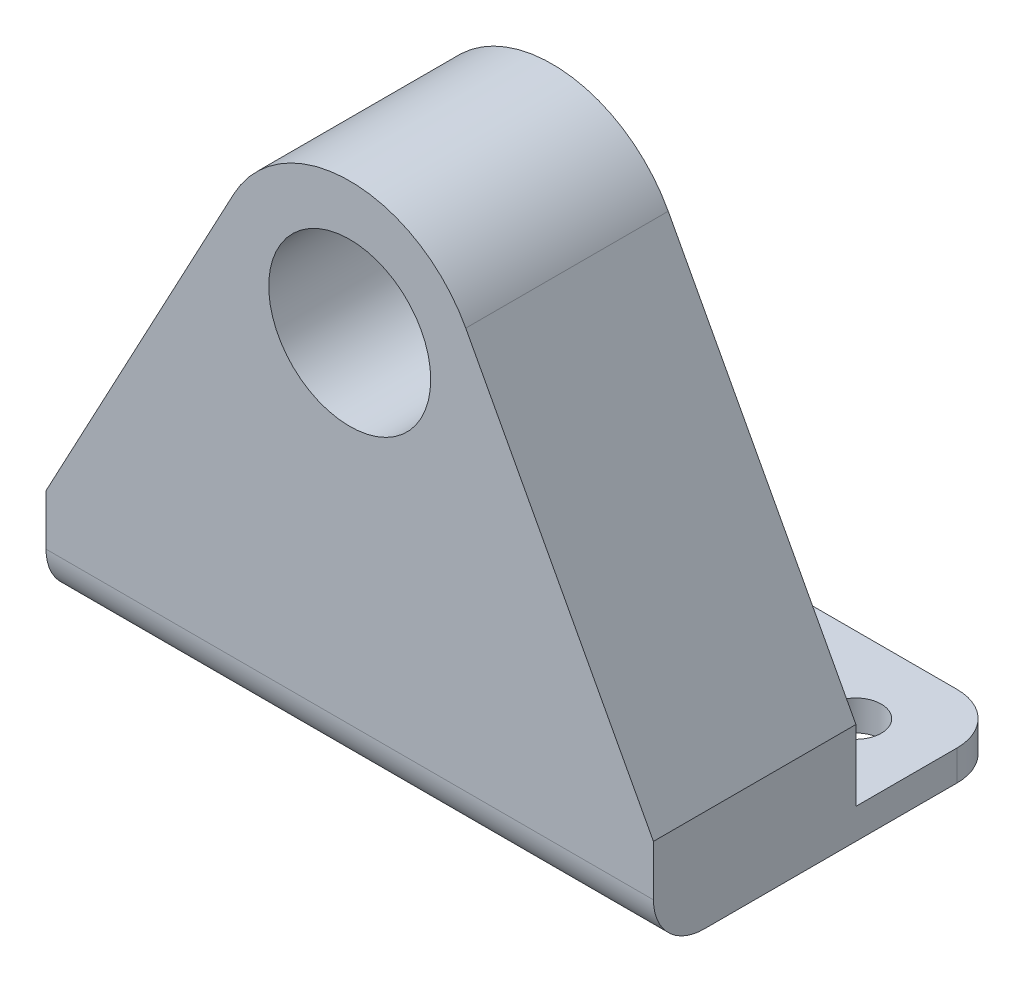
ISO-10303-21;
HEADER;
FILE_DESCRIPTION(('STEP AP214'),'2;1');
FILE_NAME('part.step','',(''),(''),'','','');
FILE_SCHEMA(('AUTOMOTIVE_DESIGN { 1 0 10303 214 1 1 1 1 }'));
ENDSEC;
DATA;
#1=APPLICATION_CONTEXT('core data for automotive mechanical design processes');
#2=APPLICATION_PROTOCOL_DEFINITION('international standard','automotive_design',2000,#1);
#3=PRODUCT_CONTEXT('',#1,'mechanical');
#4=PRODUCT('Part','Part','',(#3));
#5=PRODUCT_RELATED_PRODUCT_CATEGORY('part','',(#4));
#6=PRODUCT_DEFINITION_FORMATION('','',#4);
#7=PRODUCT_DEFINITION_CONTEXT('part definition',#1,'design');
#8=PRODUCT_DEFINITION('design','',#6,#7);
#9=PRODUCT_DEFINITION_SHAPE('','',#8);
#10=(LENGTH_UNIT() NAMED_UNIT(*) SI_UNIT(.MILLI.,.METRE.));
#11=(NAMED_UNIT(*) PLANE_ANGLE_UNIT() SI_UNIT($,.RADIAN.));
#12=(NAMED_UNIT(*) SI_UNIT($,.STERADIAN.) SOLID_ANGLE_UNIT());
#13=UNCERTAINTY_MEASURE_WITH_UNIT(LENGTH_MEASURE(1.E-05),#10,'distance_accuracy_value','');
#14=(GEOMETRIC_REPRESENTATION_CONTEXT(3) GLOBAL_UNCERTAINTY_ASSIGNED_CONTEXT((#13)) GLOBAL_UNIT_ASSIGNED_CONTEXT((#10,
#11,#12)) REPRESENTATION_CONTEXT('',''));
#15=CARTESIAN_POINT('',(0.,0.,0.));
#16=DIRECTION('',(0.,0.,1.));
#17=DIRECTION('',(1.,0.,0.));
#18=AXIS2_PLACEMENT_3D('',#15,#16,#17);
#19=CARTESIAN_POINT('',(0.,0.,0.));
#20=DIRECTION('',(0.,0.,1.));
#21=DIRECTION('',(1.,0.,0.));
#22=AXIS2_PLACEMENT_3D('',#19,#20,#21);
#23=PLANE('',#22);
#24=CARTESIAN_POINT('',(0.,0.,0.));
#25=DIRECTION('',(0.,0.,1.));
#26=DIRECTION('',(1.,0.,0.));
#27=AXIS2_PLACEMENT_3D('',#24,#25,#26);
#28=CIRCLE('',#27,8.);
#29=CARTESIAN_POINT('',(8.,0.,0.));
#30=VERTEX_POINT('',#29);
#31=EDGE_CURVE('E156',#30,#30,#28,.T.);
#32=ORIENTED_EDGE('',*,*,#31,.T.);
#33=EDGE_LOOP('',(#32));
#34=FACE_BOUND('',#33,.T.);
#35=DIRECTION('',(1.,0.,0.));
#36=VECTOR('',#35,1.);
#37=CARTESIAN_POINT('',(30.,-35.5,0.));
#38=LINE('',#37,#36);
#39=CARTESIAN_POINT('',(-30.,-35.5,0.));
#40=VERTEX_POINT('',#39);
#41=CARTESIAN_POINT('',(30.,-35.5,0.));
#42=VERTEX_POINT('',#41);
#43=EDGE_CURVE('E137',#40,#42,#38,.T.);
#44=ORIENTED_EDGE('',*,*,#43,.F.);
#45=DIRECTION('',(0.,-1.,0.));
#46=VECTOR('',#45,1.);
#47=CARTESIAN_POINT('',(-30.,-38.5,0.));
#48=LINE('',#47,#46);
#49=CARTESIAN_POINT('',(-30.,-28.5,0.));
#50=VERTEX_POINT('',#49);
#51=EDGE_CURVE('E164',#50,#40,#48,.T.);
#52=ORIENTED_EDGE('',*,*,#51,.F.);
#53=DIRECTION('',(-0.471909255380302,-0.88164712594462,0.));
#54=VECTOR('',#53,1.);
#55=CARTESIAN_POINT('',(-30.,-28.5,0.));
#56=LINE('',#55,#54);
#57=CARTESIAN_POINT('',(-11.4614126372801,6.13482031994392,0.));
#58=VERTEX_POINT('',#57);
#59=EDGE_CURVE('E177',#58,#50,#56,.T.);
#60=ORIENTED_EDGE('',*,*,#59,.F.);
#61=CARTESIAN_POINT('',(0.,0.,0.));
#62=DIRECTION('',(0.,0.,1.));
#63=DIRECTION('',(1.,0.,0.));
#64=AXIS2_PLACEMENT_3D('',#61,#62,#63);
#65=CIRCLE('',#64,13.);
#66=CARTESIAN_POINT('',(11.4614126372801,6.13482031994393,0.));
#67=VERTEX_POINT('',#66);
#68=EDGE_CURVE('E175',#67,#58,#65,.T.);
#69=ORIENTED_EDGE('',*,*,#68,.F.);
#70=DIRECTION('',(-0.471909255380302,0.88164712594462,0.));
#71=VECTOR('',#70,1.);
#72=CARTESIAN_POINT('',(30.,-28.5,0.));
#73=LINE('',#72,#71);
#74=CARTESIAN_POINT('',(30.,-28.5,0.));
#75=VERTEX_POINT('',#74);
#76=EDGE_CURVE('E140',#75,#67,#73,.T.);
#77=ORIENTED_EDGE('',*,*,#76,.F.);
#78=DIRECTION('',(0.,1.,0.));
#79=VECTOR('',#78,1.);
#80=CARTESIAN_POINT('',(30.,-28.5,0.));
#81=LINE('',#80,#79);
#82=EDGE_CURVE('E124',#42,#75,#81,.T.);
#83=ORIENTED_EDGE('',*,*,#82,.F.);
#84=EDGE_LOOP('',(#44,#52,#60,#69,#77,#83));
#85=FACE_BOUND('',#84,.T.);
#86=ADVANCED_FACE('F38',(#34,#85),#23,.F.);
#87=CARTESIAN_POINT('',(0.,0.,20.));
#88=DIRECTION('',(0.,0.,1.));
#89=DIRECTION('',(1.,0.,0.));
#90=AXIS2_PLACEMENT_3D('',#87,#88,#89);
#91=PLANE('',#90);
#92=DIRECTION('',(0.,-1.,0.));
#93=VECTOR('',#92,1.);
#94=CARTESIAN_POINT('',(-30.,-38.5,20.));
#95=LINE('',#94,#93);
#96=CARTESIAN_POINT('',(-30.,-28.5,20.));
#97=VERTEX_POINT('',#96);
#98=CARTESIAN_POINT('',(-30.,-33.5,20.));
#99=VERTEX_POINT('',#98);
#100=EDGE_CURVE('E170',#97,#99,#95,.T.);
#101=ORIENTED_EDGE('',*,*,#100,.T.);
#102=DIRECTION('',(1.,0.,0.));
#103=VECTOR('',#102,1.);
#104=CARTESIAN_POINT('',(30.,-33.5,20.));
#105=LINE('',#104,#103);
#106=CARTESIAN_POINT('',(30.,-33.5,20.));
#107=VERTEX_POINT('',#106);
#108=EDGE_CURVE('E195',#99,#107,#105,.T.);
#109=ORIENTED_EDGE('',*,*,#108,.T.);
#110=DIRECTION('',(0.,1.,0.));
#111=VECTOR('',#110,1.);
#112=CARTESIAN_POINT('',(30.,-28.5,20.));
#113=LINE('',#112,#111);
#114=CARTESIAN_POINT('',(30.,-28.5,20.));
#115=VERTEX_POINT('',#114);
#116=EDGE_CURVE('E161',#107,#115,#113,.T.);
#117=ORIENTED_EDGE('',*,*,#116,.T.);
#118=DIRECTION('',(-0.471909255380302,0.88164712594462,0.));
#119=VECTOR('',#118,1.);
#120=CARTESIAN_POINT('',(30.,-28.5,20.));
#121=LINE('',#120,#119);
#122=CARTESIAN_POINT('',(11.4614126372801,6.13482031994393,20.));
#123=VERTEX_POINT('',#122);
#124=EDGE_CURVE('E163',#115,#123,#121,.T.);
#125=ORIENTED_EDGE('',*,*,#124,.T.);
#126=CARTESIAN_POINT('',(0.,0.,20.));
#127=DIRECTION('',(0.,0.,1.));
#128=DIRECTION('',(1.,0.,0.));
#129=AXIS2_PLACEMENT_3D('',#126,#127,#128);
#130=CIRCLE('',#129,13.);
#131=CARTESIAN_POINT('',(-11.4614126372801,6.13482031994392,20.));
#132=VERTEX_POINT('',#131);
#133=EDGE_CURVE('E166',#123,#132,#130,.T.);
#134=ORIENTED_EDGE('',*,*,#133,.T.);
#135=DIRECTION('',(-0.471909255380302,-0.88164712594462,0.));
#136=VECTOR('',#135,1.);
#137=CARTESIAN_POINT('',(-30.,-28.5,20.));
#138=LINE('',#137,#136);
#139=EDGE_CURVE('E168',#132,#97,#138,.T.);
#140=ORIENTED_EDGE('',*,*,#139,.T.);
#141=EDGE_LOOP('',(#101,#109,#117,#125,#134,#140));
#142=FACE_BOUND('',#141,.T.);
#143=CARTESIAN_POINT('',(0.,0.,20.));
#144=DIRECTION('',(0.,0.,1.));
#145=DIRECTION('',(1.,0.,0.));
#146=AXIS2_PLACEMENT_3D('',#143,#144,#145);
#147=CIRCLE('',#146,8.);
#148=CARTESIAN_POINT('',(8.,0.,20.));
#149=VERTEX_POINT('',#148);
#150=EDGE_CURVE('E141',#149,#149,#147,.T.);
#151=ORIENTED_EDGE('',*,*,#150,.F.);
#152=EDGE_LOOP('',(#151));
#153=FACE_BOUND('',#152,.T.);
#154=ADVANCED_FACE('F237',(#142,#153),#91,.T.);
#155=CARTESIAN_POINT('',(30.,-38.5,20.));
#156=DIRECTION('',(0.,1.,0.));
#157=DIRECTION('',(-1.,0.,0.));
#158=AXIS2_PLACEMENT_3D('',#155,#156,#157);
#159=PLANE('',#158);
#160=CARTESIAN_POINT('',(22.5,-38.5,-7.5));
#161=DIRECTION('',(0.,-1.,0.));
#162=DIRECTION('',(1.,0.,0.));
#163=AXIS2_PLACEMENT_3D('',#160,#161,#162);
#164=CIRCLE('',#163,2.5);
#165=CARTESIAN_POINT('',(25.,-38.5,-7.5));
#166=VERTEX_POINT('',#165);
#167=EDGE_CURVE('E197',#166,#166,#164,.T.);
#168=ORIENTED_EDGE('',*,*,#167,.F.);
#169=EDGE_LOOP('',(#168));
#170=FACE_BOUND('',#169,.T.);
#171=CARTESIAN_POINT('',(-22.5,-38.5,-7.5));
#172=DIRECTION('',(0.,-1.,0.));
#173=DIRECTION('',(1.,0.,0.));
#174=AXIS2_PLACEMENT_3D('',#171,#172,#173);
#175=CIRCLE('',#174,2.5);
#176=CARTESIAN_POINT('',(-20.,-38.5,-7.5));
#177=VERTEX_POINT('',#176);
#178=EDGE_CURVE('E404',#177,#177,#175,.T.);
#179=ORIENTED_EDGE('',*,*,#178,.F.);
#180=EDGE_LOOP('',(#179));
#181=FACE_BOUND('',#180,.T.);
#182=DIRECTION('',(0.,0.,-1.));
#183=VECTOR('',#182,1.);
#184=CARTESIAN_POINT('',(30.,-38.5,20.));
#185=LINE('',#184,#183);
#186=CARTESIAN_POINT('',(30.,-38.5,15.));
#187=VERTEX_POINT('',#186);
#188=CARTESIAN_POINT('',(30.,-38.5,-10.));
#189=VERTEX_POINT('',#188);
#190=EDGE_CURVE('E193',#187,#189,#185,.T.);
#191=ORIENTED_EDGE('',*,*,#190,.F.);
#192=DIRECTION('',(1.,0.,0.));
#193=VECTOR('',#192,1.);
#194=CARTESIAN_POINT('',(-30.,-38.5,15.));
#195=LINE('',#194,#193);
#196=CARTESIAN_POINT('',(-30.,-38.5,15.));
#197=VERTEX_POINT('',#196);
#198=EDGE_CURVE('E208',#187,#197,#195,.F.);
#199=ORIENTED_EDGE('',*,*,#198,.T.);
#200=DIRECTION('',(0.,0.,-1.));
#201=VECTOR('',#200,1.);
#202=CARTESIAN_POINT('',(-30.,-38.5,20.));
#203=LINE('',#202,#201);
#204=CARTESIAN_POINT('',(-30.,-38.5,-10.));
#205=VERTEX_POINT('',#204);
#206=EDGE_CURVE('E172',#197,#205,#203,.T.);
#207=ORIENTED_EDGE('',*,*,#206,.T.);
#208=CARTESIAN_POINT('',(-25.,-38.5,-10.));
#209=DIRECTION('',(0.,1.,0.));
#210=DIRECTION('',(-1.,0.,0.));
#211=AXIS2_PLACEMENT_3D('',#208,#209,#210);
#212=CIRCLE('',#211,5.);
#213=CARTESIAN_POINT('',(-25.,-38.5,-15.));
#214=VERTEX_POINT('',#213);
#215=EDGE_CURVE('E204',#205,#214,#212,.F.);
#216=ORIENTED_EDGE('',*,*,#215,.T.);
#217=DIRECTION('',(-1.,0.,0.));
#218=VECTOR('',#217,1.);
#219=CARTESIAN_POINT('',(30.,-38.5,-15.));
#220=LINE('',#219,#218);
#221=CARTESIAN_POINT('',(25.,-38.5,-15.));
#222=VERTEX_POINT('',#221);
#223=EDGE_CURVE('E145',#222,#214,#220,.T.);
#224=ORIENTED_EDGE('',*,*,#223,.F.);
#225=CARTESIAN_POINT('',(25.,-38.5,-10.));
#226=DIRECTION('',(0.,1.,0.));
#227=DIRECTION('',(-1.,0.,0.));
#228=AXIS2_PLACEMENT_3D('',#225,#226,#227);
#229=CIRCLE('',#228,5.);
#230=EDGE_CURVE('E206',#222,#189,#229,.F.);
#231=ORIENTED_EDGE('',*,*,#230,.T.);
#232=EDGE_LOOP('',(#191,#199,#207,#216,#224,#231));
#233=FACE_BOUND('',#232,.T.);
#234=ADVANCED_FACE('F225',(#170,#181,#233),#159,.F.);
#235=CARTESIAN_POINT('',(30.,-28.5,20.));
#236=DIRECTION('',(-1.,0.,0.));
#237=DIRECTION('',(0.,0.,1.));
#238=AXIS2_PLACEMENT_3D('',#235,#236,#237);
#239=PLANE('',#238);
#240=ORIENTED_EDGE('',*,*,#116,.F.);
#241=CARTESIAN_POINT('',(30.,-33.5,15.));
#242=DIRECTION('',(-1.,0.,0.));
#243=DIRECTION('',(0.,0.,1.));
#244=AXIS2_PLACEMENT_3D('',#241,#242,#243);
#245=CIRCLE('',#244,5.);
#246=EDGE_CURVE('E202',#107,#187,#245,.F.);
#247=ORIENTED_EDGE('',*,*,#246,.T.);
#248=ORIENTED_EDGE('',*,*,#190,.T.);
#249=DIRECTION('',(0.,-1.,0.));
#250=VECTOR('',#249,1.);
#251=CARTESIAN_POINT('',(30.,-28.5,-10.));
#252=LINE('',#251,#250);
#253=CARTESIAN_POINT('',(30.,-35.5,-10.));
#254=VERTEX_POINT('',#253);
#255=EDGE_CURVE('E128',#189,#254,#252,.F.);
#256=ORIENTED_EDGE('',*,*,#255,.T.);
#257=DIRECTION('',(0.,0.,1.));
#258=VECTOR('',#257,1.);
#259=CARTESIAN_POINT('',(30.,-35.5,-15.));
#260=LINE('',#259,#258);
#261=EDGE_CURVE('E119',#254,#42,#260,.T.);
#262=ORIENTED_EDGE('',*,*,#261,.T.);
#263=ORIENTED_EDGE('',*,*,#82,.T.);
#264=DIRECTION('',(0.,0.,-1.));
#265=VECTOR('',#264,1.);
#266=CARTESIAN_POINT('',(30.,-28.5,20.));
#267=LINE('',#266,#265);
#268=EDGE_CURVE('E191',#115,#75,#267,.T.);
#269=ORIENTED_EDGE('',*,*,#268,.F.);
#270=EDGE_LOOP('',(#240,#247,#248,#256,#262,#263,#269));
#271=FACE_BOUND('',#270,.T.);
#272=ADVANCED_FACE('F122',(#271),#239,.F.);
#273=CARTESIAN_POINT('',(30.,-28.5,20.));
#274=DIRECTION('',(-0.88164712594462,-0.471909255380302,0.));
#275=DIRECTION('',(0.471909255380302,-0.88164712594462,0.));
#276=AXIS2_PLACEMENT_3D('',#273,#274,#275);
#277=PLANE('',#276);
#278=ORIENTED_EDGE('',*,*,#76,.T.);
#279=DIRECTION('',(0.,0.,-1.));
#280=VECTOR('',#279,1.);
#281=CARTESIAN_POINT('',(11.4614126372801,6.13482031994393,20.));
#282=LINE('',#281,#280);
#283=EDGE_CURVE('E188',#123,#67,#282,.T.);
#284=ORIENTED_EDGE('',*,*,#283,.F.);
#285=ORIENTED_EDGE('',*,*,#124,.F.);
#286=ORIENTED_EDGE('',*,*,#268,.T.);
#287=EDGE_LOOP('',(#278,#284,#285,#286));
#288=FACE_BOUND('',#287,.T.);
#289=ADVANCED_FACE('F252',(#288),#277,.F.);
#290=CARTESIAN_POINT('',(0.,0.,20.));
#291=DIRECTION('',(0.,0.,-1.));
#292=DIRECTION('',(-1.,0.,0.));
#293=AXIS2_PLACEMENT_3D('',#290,#291,#292);
#294=CYLINDRICAL_SURFACE('',#293,13.);
#295=ORIENTED_EDGE('',*,*,#68,.T.);
#296=DIRECTION('',(0.,0.,-1.));
#297=VECTOR('',#296,1.);
#298=CARTESIAN_POINT('',(-11.4614126372801,6.13482031994392,20.));
#299=LINE('',#298,#297);
#300=EDGE_CURVE('E185',#132,#58,#299,.T.);
#301=ORIENTED_EDGE('',*,*,#300,.F.);
#302=ORIENTED_EDGE('',*,*,#133,.F.);
#303=ORIENTED_EDGE('',*,*,#283,.T.);
#304=EDGE_LOOP('',(#295,#301,#302,#303));
#305=FACE_BOUND('',#304,.T.);
#306=ADVANCED_FACE('F248',(#305),#294,.T.);
#307=CARTESIAN_POINT('',(-30.,-28.5,20.));
#308=DIRECTION('',(0.88164712594462,-0.471909255380302,0.));
#309=DIRECTION('',(0.471909255380302,0.88164712594462,0.));
#310=AXIS2_PLACEMENT_3D('',#307,#308,#309);
#311=PLANE('',#310);
#312=ORIENTED_EDGE('',*,*,#59,.T.);
#313=DIRECTION('',(0.,0.,-1.));
#314=VECTOR('',#313,1.);
#315=CARTESIAN_POINT('',(-30.,-28.5,20.));
#316=LINE('',#315,#314);
#317=EDGE_CURVE('E182',#97,#50,#316,.T.);
#318=ORIENTED_EDGE('',*,*,#317,.F.);
#319=ORIENTED_EDGE('',*,*,#139,.F.);
#320=ORIENTED_EDGE('',*,*,#300,.T.);
#321=EDGE_LOOP('',(#312,#318,#319,#320));
#322=FACE_BOUND('',#321,.T.);
#323=ADVANCED_FACE('F244',(#322),#311,.F.);
#324=CARTESIAN_POINT('',(-30.,-38.5,20.));
#325=DIRECTION('',(1.,0.,0.));
#326=DIRECTION('',(0.,1.,0.));
#327=AXIS2_PLACEMENT_3D('',#324,#325,#326);
#328=PLANE('',#327);
#329=ORIENTED_EDGE('',*,*,#206,.F.);
#330=CARTESIAN_POINT('',(-30.,-33.5,15.));
#331=DIRECTION('',(1.,0.,0.));
#332=DIRECTION('',(0.,1.,0.));
#333=AXIS2_PLACEMENT_3D('',#330,#331,#332);
#334=CIRCLE('',#333,5.);
#335=EDGE_CURVE('E212',#197,#99,#334,.F.);
#336=ORIENTED_EDGE('',*,*,#335,.T.);
#337=ORIENTED_EDGE('',*,*,#100,.F.);
#338=ORIENTED_EDGE('',*,*,#317,.T.);
#339=ORIENTED_EDGE('',*,*,#51,.T.);
#340=DIRECTION('',(0.,0.,1.));
#341=VECTOR('',#340,1.);
#342=CARTESIAN_POINT('',(-30.,-35.5,-15.));
#343=LINE('',#342,#341);
#344=CARTESIAN_POINT('',(-30.,-35.5,-10.));
#345=VERTEX_POINT('',#344);
#346=EDGE_CURVE('E130',#345,#40,#343,.T.);
#347=ORIENTED_EDGE('',*,*,#346,.F.);
#348=DIRECTION('',(0.,1.,0.));
#349=VECTOR('',#348,1.);
#350=CARTESIAN_POINT('',(-30.,-38.5,-10.));
#351=LINE('',#350,#349);
#352=EDGE_CURVE('E210',#345,#205,#351,.F.);
#353=ORIENTED_EDGE('',*,*,#352,.T.);
#354=EDGE_LOOP('',(#329,#336,#337,#338,#339,#347,#353));
#355=FACE_BOUND('',#354,.T.);
#356=ADVANCED_FACE('F220',(#355),#328,.F.);
#357=CARTESIAN_POINT('',(0.,0.,20.));
#358=DIRECTION('',(0.,0.,-1.));
#359=DIRECTION('',(-1.,0.,0.));
#360=AXIS2_PLACEMENT_3D('',#357,#358,#359);
#361=CYLINDRICAL_SURFACE('',#360,8.);
#362=ORIENTED_EDGE('',*,*,#150,.T.);
#363=EDGE_LOOP('',(#362));
#364=FACE_BOUND('',#363,.T.);
#365=ORIENTED_EDGE('',*,*,#31,.F.);
#366=EDGE_LOOP('',(#365));
#367=FACE_BOUND('',#366,.T.);
#368=ADVANCED_FACE('F275',(#364,#367),#361,.F.);
#369=CARTESIAN_POINT('',(30.,-35.5,-15.));
#370=DIRECTION('',(0.,-1.,0.));
#371=DIRECTION('',(0.,0.,-1.));
#372=AXIS2_PLACEMENT_3D('',#369,#370,#371);
#373=PLANE('',#372);
#374=CARTESIAN_POINT('',(22.5,-35.5,-7.5));
#375=DIRECTION('',(0.,-1.,0.));
#376=DIRECTION('',(0.,0.,-1.));
#377=AXIS2_PLACEMENT_3D('',#374,#375,#376);
#378=CIRCLE('',#377,2.5);
#379=CARTESIAN_POINT('',(22.5,-35.5,-10.));
#380=VERTEX_POINT('',#379);
#381=EDGE_CURVE('E146',#380,#380,#378,.T.);
#382=ORIENTED_EDGE('',*,*,#381,.T.);
#383=EDGE_LOOP('',(#382));
#384=FACE_BOUND('',#383,.T.);
#385=CARTESIAN_POINT('',(-22.5,-35.5,-7.5));
#386=DIRECTION('',(0.,-1.,0.));
#387=DIRECTION('',(0.,0.,-1.));
#388=AXIS2_PLACEMENT_3D('',#385,#386,#387);
#389=CIRCLE('',#388,2.5);
#390=CARTESIAN_POINT('',(-22.5,-35.5,-10.));
#391=VERTEX_POINT('',#390);
#392=EDGE_CURVE('E151',#391,#391,#389,.T.);
#393=ORIENTED_EDGE('',*,*,#392,.T.);
#394=EDGE_LOOP('',(#393));
#395=FACE_BOUND('',#394,.T.);
#396=ORIENTED_EDGE('',*,*,#261,.F.);
#397=CARTESIAN_POINT('',(25.,-35.5,-10.));
#398=DIRECTION('',(0.,-1.,0.));
#399=DIRECTION('',(0.,0.,-1.));
#400=AXIS2_PLACEMENT_3D('',#397,#398,#399);
#401=CIRCLE('',#400,5.);
#402=CARTESIAN_POINT('',(25.,-35.5,-15.));
#403=VERTEX_POINT('',#402);
#404=EDGE_CURVE('E11',#254,#403,#401,.F.);
#405=ORIENTED_EDGE('',*,*,#404,.T.);
#406=DIRECTION('',(1.,0.,0.));
#407=VECTOR('',#406,1.);
#408=CARTESIAN_POINT('',(30.,-35.5,-15.));
#409=LINE('',#408,#407);
#410=CARTESIAN_POINT('',(-25.,-35.5,-15.));
#411=VERTEX_POINT('',#410);
#412=EDGE_CURVE('E131',#411,#403,#409,.T.);
#413=ORIENTED_EDGE('',*,*,#412,.F.);
#414=CARTESIAN_POINT('',(-25.,-35.5,-10.));
#415=DIRECTION('',(0.,-1.,0.));
#416=DIRECTION('',(0.,0.,-1.));
#417=AXIS2_PLACEMENT_3D('',#414,#415,#416);
#418=CIRCLE('',#417,5.);
#419=EDGE_CURVE('E46',#411,#345,#418,.F.);
#420=ORIENTED_EDGE('',*,*,#419,.T.);
#421=ORIENTED_EDGE('',*,*,#346,.T.);
#422=ORIENTED_EDGE('',*,*,#43,.T.);
#423=EDGE_LOOP('',(#396,#405,#413,#420,#421,#422));
#424=FACE_BOUND('',#423,.T.);
#425=ADVANCED_FACE('F143',(#384,#395,#424),#373,.F.);
#426=CARTESIAN_POINT('',(0.,0.,-15.));
#427=DIRECTION('',(0.,0.,1.));
#428=DIRECTION('',(1.,0.,0.));
#429=AXIS2_PLACEMENT_3D('',#426,#427,#428);
#430=PLANE('',#429);
#431=ORIENTED_EDGE('',*,*,#412,.T.);
#432=DIRECTION('',(0.,-1.,0.));
#433=VECTOR('',#432,1.);
#434=CARTESIAN_POINT('',(25.,0.,-15.));
#435=LINE('',#434,#433);
#436=EDGE_CURVE('E216',#403,#222,#435,.T.);
#437=ORIENTED_EDGE('',*,*,#436,.T.);
#438=ORIENTED_EDGE('',*,*,#223,.T.);
#439=DIRECTION('',(0.,1.,0.));
#440=VECTOR('',#439,1.);
#441=CARTESIAN_POINT('',(-25.,0.,-15.));
#442=LINE('',#441,#440);
#443=EDGE_CURVE('E214',#214,#411,#442,.T.);
#444=ORIENTED_EDGE('',*,*,#443,.T.);
#445=EDGE_LOOP('',(#431,#437,#438,#444));
#446=FACE_BOUND('',#445,.T.);
#447=ADVANCED_FACE('F227',(#446),#430,.F.);
#448=CARTESIAN_POINT('',(-22.5,-18.5,-7.5));
#449=DIRECTION('',(0.,-1.,0.));
#450=DIRECTION('',(1.,0.,0.));
#451=AXIS2_PLACEMENT_3D('',#448,#449,#450);
#452=CYLINDRICAL_SURFACE('',#451,2.5);
#453=ORIENTED_EDGE('',*,*,#178,.T.);
#454=EDGE_LOOP('',(#453));
#455=FACE_BOUND('',#454,.T.);
#456=ORIENTED_EDGE('',*,*,#392,.F.);
#457=EDGE_LOOP('',(#456));
#458=FACE_BOUND('',#457,.T.);
#459=ADVANCED_FACE('F330',(#455,#458),#452,.F.);
#460=CARTESIAN_POINT('',(22.5,-18.5,-7.5));
#461=DIRECTION('',(0.,-1.,0.));
#462=DIRECTION('',(1.,0.,0.));
#463=AXIS2_PLACEMENT_3D('',#460,#461,#462);
#464=CYLINDRICAL_SURFACE('',#463,2.5);
#465=ORIENTED_EDGE('',*,*,#167,.T.);
#466=EDGE_LOOP('',(#465));
#467=FACE_BOUND('',#466,.T.);
#468=ORIENTED_EDGE('',*,*,#381,.F.);
#469=EDGE_LOOP('',(#468));
#470=FACE_BOUND('',#469,.T.);
#471=ADVANCED_FACE('F339',(#467,#470),#464,.F.);
#472=CARTESIAN_POINT('',(0.,-33.5,15.));
#473=DIRECTION('',(-1.,0.,0.));
#474=DIRECTION('',(0.,-1.,0.));
#475=AXIS2_PLACEMENT_3D('',#472,#473,#474);
#476=CYLINDRICAL_SURFACE('',#475,5.);
#477=ORIENTED_EDGE('',*,*,#335,.F.);
#478=ORIENTED_EDGE('',*,*,#198,.F.);
#479=ORIENTED_EDGE('',*,*,#246,.F.);
#480=ORIENTED_EDGE('',*,*,#108,.F.);
#481=EDGE_LOOP('',(#477,#478,#479,#480));
#482=FACE_BOUND('',#481,.T.);
#483=ADVANCED_FACE('F235',(#482),#476,.T.);
#484=CARTESIAN_POINT('',(25.,0.,-10.));
#485=DIRECTION('',(0.,-1.,0.));
#486=DIRECTION('',(0.,0.,-1.));
#487=AXIS2_PLACEMENT_3D('',#484,#485,#486);
#488=CYLINDRICAL_SURFACE('',#487,5.);
#489=ORIENTED_EDGE('',*,*,#404,.F.);
#490=ORIENTED_EDGE('',*,*,#255,.F.);
#491=ORIENTED_EDGE('',*,*,#230,.F.);
#492=ORIENTED_EDGE('',*,*,#436,.F.);
#493=EDGE_LOOP('',(#489,#490,#491,#492));
#494=FACE_BOUND('',#493,.T.);
#495=ADVANCED_FACE('F230',(#494),#488,.T.);
#496=CARTESIAN_POINT('',(-25.,0.,-10.));
#497=DIRECTION('',(0.,1.,0.));
#498=DIRECTION('',(-1.,0.,0.));
#499=AXIS2_PLACEMENT_3D('',#496,#497,#498);
#500=CYLINDRICAL_SURFACE('',#499,5.);
#501=ORIENTED_EDGE('',*,*,#215,.F.);
#502=ORIENTED_EDGE('',*,*,#352,.F.);
#503=ORIENTED_EDGE('',*,*,#419,.F.);
#504=ORIENTED_EDGE('',*,*,#443,.F.);
#505=EDGE_LOOP('',(#501,#502,#503,#504));
#506=FACE_BOUND('',#505,.T.);
#507=ADVANCED_FACE('F40',(#506),#500,.T.);
#508=CLOSED_SHELL('',(#86,#154,#234,#272,#289,#306,#323,#356,#368,#425,#447,#459,#471,#483,#495,#507));
#509=MANIFOLD_SOLID_BREP('B2',#508);
#510=ADVANCED_BREP_SHAPE_REPRESENTATION('',(#18,#509),#14);
#511=SHAPE_DEFINITION_REPRESENTATION(#9,#510);
ENDSEC;
END-ISO-10303-21;
